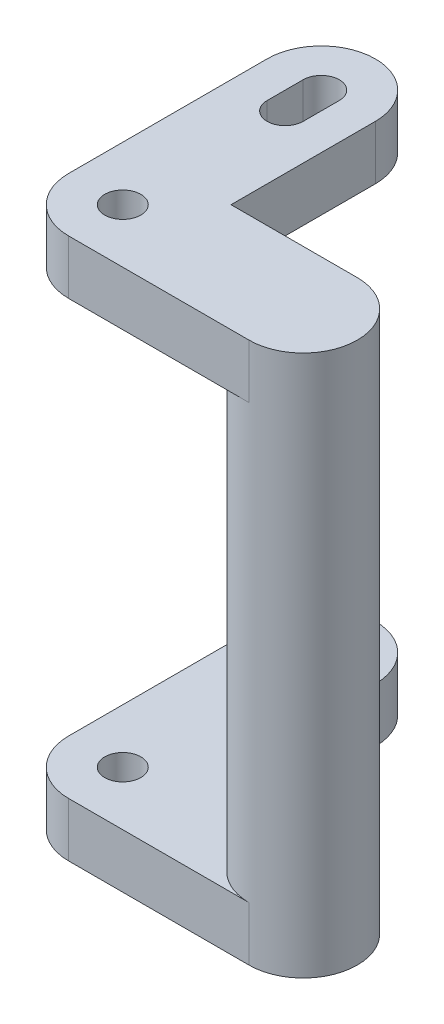
ISO-10303-21;
HEADER;
FILE_DESCRIPTION(('STEP AP214'),'2;1');
FILE_NAME('part.step','',(''),(''),'','','');
FILE_SCHEMA(('AUTOMOTIVE_DESIGN { 1 0 10303 214 1 1 1 1 }'));
ENDSEC;
DATA;
#1=APPLICATION_CONTEXT('core data for automotive mechanical design processes');
#2=APPLICATION_PROTOCOL_DEFINITION('international standard','automotive_design',2000,#1);
#3=PRODUCT_CONTEXT('',#1,'mechanical');
#4=PRODUCT('Part','Part','',(#3));
#5=PRODUCT_RELATED_PRODUCT_CATEGORY('part','',(#4));
#6=PRODUCT_DEFINITION_FORMATION('','',#4);
#7=PRODUCT_DEFINITION_CONTEXT('part definition',#1,'design');
#8=PRODUCT_DEFINITION('design','',#6,#7);
#9=PRODUCT_DEFINITION_SHAPE('','',#8);
#10=(LENGTH_UNIT() NAMED_UNIT(*) SI_UNIT(.MILLI.,.METRE.));
#11=(NAMED_UNIT(*) PLANE_ANGLE_UNIT() SI_UNIT($,.RADIAN.));
#12=(NAMED_UNIT(*) SI_UNIT($,.STERADIAN.) SOLID_ANGLE_UNIT());
#13=UNCERTAINTY_MEASURE_WITH_UNIT(LENGTH_MEASURE(1.E-05),#10,'distance_accuracy_value','');
#14=(GEOMETRIC_REPRESENTATION_CONTEXT(3) GLOBAL_UNCERTAINTY_ASSIGNED_CONTEXT((#13)) GLOBAL_UNIT_ASSIGNED_CONTEXT((#10,
#11,#12)) REPRESENTATION_CONTEXT('',''));
#15=CARTESIAN_POINT('',(0.,0.,0.));
#16=DIRECTION('',(0.,0.,1.));
#17=DIRECTION('',(1.,0.,0.));
#18=AXIS2_PLACEMENT_3D('',#15,#16,#17);
#19=CARTESIAN_POINT('',(0.,1.5,-3.));
#20=DIRECTION('',(0.,1.,0.));
#21=DIRECTION('',(0.,0.,1.));
#22=AXIS2_PLACEMENT_3D('',#19,#20,#21);
#23=PLANE('',#22);
#24=CARTESIAN_POINT('',(5.,1.5,2.50000000000002));
#25=DIRECTION('',(0.,1.,0.));
#26=DIRECTION('',(0.,0.,1.));
#27=AXIS2_PLACEMENT_3D('',#24,#25,#26);
#28=CIRCLE('',#27,1.5);
#29=CARTESIAN_POINT('',(5.00000000000001,1.5,1.00000000000002));
#30=VERTEX_POINT('',#29);
#31=CARTESIAN_POINT('',(5.,1.5,4.00000000000002));
#32=VERTEX_POINT('',#31);
#33=EDGE_CURVE('E11',#30,#32,#28,.T.);
#34=ORIENTED_EDGE('',*,*,#33,.F.);
#35=DIRECTION('',(-1.,0.,0.));
#36=VECTOR('',#35,1.);
#37=CARTESIAN_POINT('',(5.00000000000001,1.5,1.00000000000002));
#38=LINE('',#37,#36);
#39=CARTESIAN_POINT('',(1.5,1.5,1.00000000000001));
#40=VERTEX_POINT('',#39);
#41=EDGE_CURVE('E326',#30,#40,#38,.T.);
#42=ORIENTED_EDGE('',*,*,#41,.T.);
#43=DIRECTION('',(0.,0.,-1.));
#44=VECTOR('',#43,1.);
#45=CARTESIAN_POINT('',(1.5,1.5,-2.5));
#46=LINE('',#45,#44);
#47=CARTESIAN_POINT('',(1.5,1.5,-3.));
#48=VERTEX_POINT('',#47);
#49=EDGE_CURVE('E328',#40,#48,#46,.T.);
#50=ORIENTED_EDGE('',*,*,#49,.T.);
#51=CARTESIAN_POINT('',(0.,1.5,-3.));
#52=DIRECTION('',(0.,1.,0.));
#53=DIRECTION('',(0.,0.,1.));
#54=AXIS2_PLACEMENT_3D('',#51,#52,#53);
#55=CIRCLE('',#54,1.5);
#56=CARTESIAN_POINT('',(-1.5,1.5,-3.));
#57=VERTEX_POINT('',#56);
#58=EDGE_CURVE('E330',#48,#57,#55,.T.);
#59=ORIENTED_EDGE('',*,*,#58,.T.);
#60=DIRECTION('',(0.,0.,1.));
#61=VECTOR('',#60,1.);
#62=CARTESIAN_POINT('',(-1.5,1.5,-2.5));
#63=LINE('',#62,#61);
#64=CARTESIAN_POINT('',(-1.5,1.5,2.5));
#65=VERTEX_POINT('',#64);
#66=EDGE_CURVE('E318',#57,#65,#63,.T.);
#67=ORIENTED_EDGE('',*,*,#66,.T.);
#68=CARTESIAN_POINT('',(0.,1.5,2.5));
#69=DIRECTION('',(0.,1.,0.));
#70=DIRECTION('',(0.,0.,1.));
#71=AXIS2_PLACEMENT_3D('',#68,#69,#70);
#72=CIRCLE('',#71,1.5);
#73=CARTESIAN_POINT('',(0.,1.5,4.));
#74=VERTEX_POINT('',#73);
#75=EDGE_CURVE('E320',#65,#74,#72,.T.);
#76=ORIENTED_EDGE('',*,*,#75,.T.);
#77=DIRECTION('',(1.,0.,0.));
#78=VECTOR('',#77,1.);
#79=CARTESIAN_POINT('',(5.,1.5,4.00000000000002));
#80=LINE('',#79,#78);
#81=EDGE_CURVE('E323',#74,#32,#80,.T.);
#82=ORIENTED_EDGE('',*,*,#81,.T.);
#83=EDGE_LOOP('',(#34,#42,#50,#59,#67,#76,#82));
#84=FACE_BOUND('',#83,.T.);
#85=CARTESIAN_POINT('',(0.,1.5,2.5));
#86=DIRECTION('',(0.,1.,0.));
#87=DIRECTION('',(0.,0.,1.));
#88=AXIS2_PLACEMENT_3D('',#85,#86,#87);
#89=CIRCLE('',#88,0.5);
#90=CARTESIAN_POINT('',(0.,1.5,3.));
#91=VERTEX_POINT('',#90);
#92=EDGE_CURVE('E312',#91,#91,#89,.T.);
#93=ORIENTED_EDGE('',*,*,#92,.F.);
#94=EDGE_LOOP('',(#93));
#95=FACE_BOUND('',#94,.T.);
#96=DIRECTION('',(0.,0.,1.));
#97=VECTOR('',#96,1.);
#98=CARTESIAN_POINT('',(-0.5,1.5,-3.));
#99=LINE('',#98,#97);
#100=CARTESIAN_POINT('',(-0.5,1.5,-3.));
#101=VERTEX_POINT('',#100);
#102=CARTESIAN_POINT('',(-0.5,1.5,-2.));
#103=VERTEX_POINT('',#102);
#104=EDGE_CURVE('E285',#101,#103,#99,.T.);
#105=ORIENTED_EDGE('',*,*,#104,.F.);
#106=CARTESIAN_POINT('',(0.,1.5,-3.));
#107=DIRECTION('',(0.,1.,0.));
#108=DIRECTION('',(0.,0.,1.));
#109=AXIS2_PLACEMENT_3D('',#106,#107,#108);
#110=CIRCLE('',#109,0.5);
#111=CARTESIAN_POINT('',(0.5,1.5,-3.));
#112=VERTEX_POINT('',#111);
#113=EDGE_CURVE('E283',#112,#101,#110,.T.);
#114=ORIENTED_EDGE('',*,*,#113,.F.);
#115=DIRECTION('',(0.,0.,-1.));
#116=VECTOR('',#115,1.);
#117=CARTESIAN_POINT('',(0.5,1.5,-3.));
#118=LINE('',#117,#116);
#119=CARTESIAN_POINT('',(0.5,1.5,-2.));
#120=VERTEX_POINT('',#119);
#121=EDGE_CURVE('E290',#120,#112,#118,.T.);
#122=ORIENTED_EDGE('',*,*,#121,.F.);
#123=CARTESIAN_POINT('',(0.,1.5,-2.));
#124=DIRECTION('',(0.,1.,0.));
#125=DIRECTION('',(0.,0.,1.));
#126=AXIS2_PLACEMENT_3D('',#123,#124,#125);
#127=CIRCLE('',#126,0.5);
#128=EDGE_CURVE('E288',#103,#120,#127,.T.);
#129=ORIENTED_EDGE('',*,*,#128,.F.);
#130=EDGE_LOOP('',(#105,#114,#122,#129));
#131=FACE_BOUND('',#130,.T.);
#132=ADVANCED_FACE('F34',(#84,#95,#131),#23,.T.);
#133=CARTESIAN_POINT('',(0.,0.,-3.));
#134=DIRECTION('',(0.,1.,0.));
#135=DIRECTION('',(0.,0.,1.));
#136=AXIS2_PLACEMENT_3D('',#133,#134,#135);
#137=PLANE('',#136);
#138=CARTESIAN_POINT('',(0.,0.,2.5));
#139=DIRECTION('',(0.,1.,0.));
#140=DIRECTION('',(0.,0.,1.));
#141=AXIS2_PLACEMENT_3D('',#138,#139,#140);
#142=CIRCLE('',#141,0.5);
#143=CARTESIAN_POINT('',(0.,0.,3.));
#144=VERTEX_POINT('',#143);
#145=EDGE_CURVE('E311',#144,#144,#142,.T.);
#146=ORIENTED_EDGE('',*,*,#145,.T.);
#147=EDGE_LOOP('',(#146));
#148=FACE_BOUND('',#147,.T.);
#149=DIRECTION('',(0.,0.,1.));
#150=VECTOR('',#149,1.);
#151=CARTESIAN_POINT('',(-1.5,0.,-2.5));
#152=LINE('',#151,#150);
#153=CARTESIAN_POINT('',(-1.5,0.,-3.));
#154=VERTEX_POINT('',#153);
#155=CARTESIAN_POINT('',(-1.5,0.,2.5));
#156=VERTEX_POINT('',#155);
#157=EDGE_CURVE('E315',#154,#156,#152,.T.);
#158=ORIENTED_EDGE('',*,*,#157,.F.);
#159=CARTESIAN_POINT('',(0.,0.,-3.));
#160=DIRECTION('',(0.,1.,0.));
#161=DIRECTION('',(0.,0.,1.));
#162=AXIS2_PLACEMENT_3D('',#159,#160,#161);
#163=CIRCLE('',#162,1.5);
#164=CARTESIAN_POINT('',(1.5,0.,-3.));
#165=VERTEX_POINT('',#164);
#166=EDGE_CURVE('E321',#165,#154,#163,.T.);
#167=ORIENTED_EDGE('',*,*,#166,.F.);
#168=DIRECTION('',(0.,0.,-1.));
#169=VECTOR('',#168,1.);
#170=CARTESIAN_POINT('',(1.5,0.,-3.));
#171=LINE('',#170,#169);
#172=CARTESIAN_POINT('',(1.5,0.,1.00000000000001));
#173=VERTEX_POINT('',#172);
#174=EDGE_CURVE('E343',#173,#165,#171,.T.);
#175=ORIENTED_EDGE('',*,*,#174,.F.);
#176=DIRECTION('',(-1.,0.,0.));
#177=VECTOR('',#176,1.);
#178=CARTESIAN_POINT('',(5.00000000000001,0.,1.00000000000002));
#179=LINE('',#178,#177);
#180=CARTESIAN_POINT('',(5.00000000000001,0.,1.00000000000002));
#181=VERTEX_POINT('',#180);
#182=EDGE_CURVE('E340',#181,#173,#179,.T.);
#183=ORIENTED_EDGE('',*,*,#182,.F.);
#184=CARTESIAN_POINT('',(5.,0.,2.50000000000002));
#185=DIRECTION('',(0.,1.,0.));
#186=DIRECTION('',(0.,0.,1.));
#187=AXIS2_PLACEMENT_3D('',#184,#185,#186);
#188=CIRCLE('',#187,1.5);
#189=CARTESIAN_POINT('',(5.,0.,4.00000000000002));
#190=VERTEX_POINT('',#189);
#191=EDGE_CURVE('E338',#190,#181,#188,.T.);
#192=ORIENTED_EDGE('',*,*,#191,.F.);
#193=DIRECTION('',(1.,0.,0.));
#194=VECTOR('',#193,1.);
#195=CARTESIAN_POINT('',(5.,0.,4.00000000000002));
#196=LINE('',#195,#194);
#197=CARTESIAN_POINT('',(0.,0.,4.));
#198=VERTEX_POINT('',#197);
#199=EDGE_CURVE('E336',#198,#190,#196,.T.);
#200=ORIENTED_EDGE('',*,*,#199,.F.);
#201=CARTESIAN_POINT('',(0.,0.,2.5));
#202=DIRECTION('',(0.,1.,0.));
#203=DIRECTION('',(0.,0.,1.));
#204=AXIS2_PLACEMENT_3D('',#201,#202,#203);
#205=CIRCLE('',#204,1.5);
#206=EDGE_CURVE('E334',#156,#198,#205,.T.);
#207=ORIENTED_EDGE('',*,*,#206,.F.);
#208=EDGE_LOOP('',(#158,#167,#175,#183,#192,#200,#207));
#209=FACE_BOUND('',#208,.T.);
#210=CARTESIAN_POINT('',(0.,0.,-3.));
#211=DIRECTION('',(0.,1.,0.));
#212=DIRECTION('',(0.,0.,1.));
#213=AXIS2_PLACEMENT_3D('',#210,#211,#212);
#214=CIRCLE('',#213,0.5);
#215=CARTESIAN_POINT('',(0.5,0.,-3.));
#216=VERTEX_POINT('',#215);
#217=CARTESIAN_POINT('',(-0.5,0.,-3.));
#218=VERTEX_POINT('',#217);
#219=EDGE_CURVE('E281',#216,#218,#214,.T.);
#220=ORIENTED_EDGE('',*,*,#219,.T.);
#221=DIRECTION('',(0.,0.,1.));
#222=VECTOR('',#221,1.);
#223=CARTESIAN_POINT('',(-0.5,0.,-3.));
#224=LINE('',#223,#222);
#225=CARTESIAN_POINT('',(-0.5,0.,-2.));
#226=VERTEX_POINT('',#225);
#227=EDGE_CURVE('E295',#218,#226,#224,.T.);
#228=ORIENTED_EDGE('',*,*,#227,.T.);
#229=CARTESIAN_POINT('',(0.,0.,-2.));
#230=DIRECTION('',(0.,1.,0.));
#231=DIRECTION('',(0.,0.,1.));
#232=AXIS2_PLACEMENT_3D('',#229,#230,#231);
#233=CIRCLE('',#232,0.5);
#234=CARTESIAN_POINT('',(0.5,0.,-2.));
#235=VERTEX_POINT('',#234);
#236=EDGE_CURVE('E298',#226,#235,#233,.T.);
#237=ORIENTED_EDGE('',*,*,#236,.T.);
#238=DIRECTION('',(0.,0.,-1.));
#239=VECTOR('',#238,1.);
#240=CARTESIAN_POINT('',(0.5,0.,-3.));
#241=LINE('',#240,#239);
#242=EDGE_CURVE('E286',#235,#216,#241,.T.);
#243=ORIENTED_EDGE('',*,*,#242,.T.);
#244=EDGE_LOOP('',(#220,#228,#237,#243));
#245=FACE_BOUND('',#244,.T.);
#246=ADVANCED_FACE('F375',(#148,#209,#245),#137,.F.);
#247=CARTESIAN_POINT('',(-1.5,1.5,-2.5));
#248=DIRECTION('',(1.,0.,0.));
#249=DIRECTION('',(0.,0.,-1.));
#250=AXIS2_PLACEMENT_3D('',#247,#248,#249);
#251=PLANE('',#250);
#252=ORIENTED_EDGE('',*,*,#157,.T.);
#253=DIRECTION('',(0.,-1.,0.));
#254=VECTOR('',#253,1.);
#255=CARTESIAN_POINT('',(-1.5,1.5,2.5));
#256=LINE('',#255,#254);
#257=EDGE_CURVE('E38',#65,#156,#256,.T.);
#258=ORIENTED_EDGE('',*,*,#257,.F.);
#259=ORIENTED_EDGE('',*,*,#66,.F.);
#260=DIRECTION('',(0.,-1.,0.));
#261=VECTOR('',#260,1.);
#262=CARTESIAN_POINT('',(-1.5,1.5,-3.));
#263=LINE('',#262,#261);
#264=EDGE_CURVE('E332',#57,#154,#263,.T.);
#265=ORIENTED_EDGE('',*,*,#264,.T.);
#266=EDGE_LOOP('',(#252,#258,#259,#265));
#267=FACE_BOUND('',#266,.T.);
#268=ADVANCED_FACE('F36',(#267),#251,.F.);
#269=CARTESIAN_POINT('',(0.,1.5,2.5));
#270=DIRECTION('',(0.,-1.,0.));
#271=DIRECTION('',(0.,0.,-1.));
#272=AXIS2_PLACEMENT_3D('',#269,#270,#271);
#273=CYLINDRICAL_SURFACE('',#272,1.5);
#274=ORIENTED_EDGE('',*,*,#206,.T.);
#275=DIRECTION('',(0.,-1.,0.));
#276=VECTOR('',#275,1.);
#277=CARTESIAN_POINT('',(0.,1.5,4.));
#278=LINE('',#277,#276);
#279=EDGE_CURVE('E360',#74,#198,#278,.T.);
#280=ORIENTED_EDGE('',*,*,#279,.F.);
#281=ORIENTED_EDGE('',*,*,#75,.F.);
#282=ORIENTED_EDGE('',*,*,#257,.T.);
#283=EDGE_LOOP('',(#274,#280,#281,#282));
#284=FACE_BOUND('',#283,.T.);
#285=ADVANCED_FACE('F371',(#284),#273,.T.);
#286=CARTESIAN_POINT('',(5.,1.5,4.00000000000002));
#287=DIRECTION('',(0.,0.,-1.));
#288=DIRECTION('',(-1.,0.,0.));
#289=AXIS2_PLACEMENT_3D('',#286,#287,#288);
#290=PLANE('',#289);
#291=ORIENTED_EDGE('',*,*,#199,.T.);
#292=DIRECTION('',(0.,-1.,0.));
#293=VECTOR('',#292,1.);
#294=CARTESIAN_POINT('',(5.,1.5,4.00000000000002));
#295=LINE('',#294,#293);
#296=EDGE_CURVE('E358',#32,#190,#295,.T.);
#297=ORIENTED_EDGE('',*,*,#296,.F.);
#298=ORIENTED_EDGE('',*,*,#81,.F.);
#299=ORIENTED_EDGE('',*,*,#279,.T.);
#300=EDGE_LOOP('',(#291,#297,#298,#299));
#301=FACE_BOUND('',#300,.T.);
#302=ADVANCED_FACE('F380',(#301),#290,.F.);
#303=CARTESIAN_POINT('',(5.,1.5,2.50000000000002));
#304=DIRECTION('',(0.,-1.,0.));
#305=DIRECTION('',(0.,0.,-1.));
#306=AXIS2_PLACEMENT_3D('',#303,#304,#305);
#307=CYLINDRICAL_SURFACE('',#306,1.5);
#308=ORIENTED_EDGE('',*,*,#191,.T.);
#309=DIRECTION('',(0.,-1.,0.));
#310=VECTOR('',#309,1.);
#311=CARTESIAN_POINT('',(5.00000000000001,1.5,1.00000000000002));
#312=LINE('',#311,#310);
#313=EDGE_CURVE('E355',#30,#181,#312,.T.);
#314=ORIENTED_EDGE('',*,*,#313,.F.);
#315=ORIENTED_EDGE('',*,*,#33,.T.);
#316=ORIENTED_EDGE('',*,*,#296,.T.);
#317=EDGE_LOOP('',(#308,#314,#315,#316));
#318=FACE_BOUND('',#317,.T.);
#319=CARTESIAN_POINT('',(5.,13.5,2.50000000000002));
#320=DIRECTION('',(0.,1.,0.));
#321=DIRECTION('',(0.,0.,1.));
#322=AXIS2_PLACEMENT_3D('',#319,#320,#321);
#323=CIRCLE('',#322,1.5);
#324=CARTESIAN_POINT('',(5.00000000000001,13.5,1.00000000000002));
#325=VERTEX_POINT('',#324);
#326=CARTESIAN_POINT('',(5.,13.5,4.00000000000002));
#327=VERTEX_POINT('',#326);
#328=EDGE_CURVE('E50',#325,#327,#323,.T.);
#329=ORIENTED_EDGE('',*,*,#328,.F.);
#330=DIRECTION('',(0.,-1.,0.));
#331=VECTOR('',#330,1.);
#332=CARTESIAN_POINT('',(5.00000000000001,15.,1.00000000000002));
#333=LINE('',#332,#331);
#334=CARTESIAN_POINT('',(5.00000000000001,15.,1.00000000000002));
#335=VERTEX_POINT('',#334);
#336=EDGE_CURVE('E265',#335,#325,#333,.T.);
#337=ORIENTED_EDGE('',*,*,#336,.F.);
#338=CARTESIAN_POINT('',(5.,15.,2.50000000000002));
#339=DIRECTION('',(0.,1.,0.));
#340=DIRECTION('',(0.,0.,-1.));
#341=AXIS2_PLACEMENT_3D('',#338,#339,#340);
#342=CIRCLE('',#341,1.5);
#343=CARTESIAN_POINT('',(5.,15.,4.00000000000002));
#344=VERTEX_POINT('',#343);
#345=EDGE_CURVE('E245',#344,#335,#342,.T.);
#346=ORIENTED_EDGE('',*,*,#345,.F.);
#347=DIRECTION('',(0.,-1.,0.));
#348=VECTOR('',#347,1.);
#349=CARTESIAN_POINT('',(5.,15.,4.00000000000002));
#350=LINE('',#349,#348);
#351=EDGE_CURVE('E267',#344,#327,#350,.T.);
#352=ORIENTED_EDGE('',*,*,#351,.T.);
#353=EDGE_LOOP('',(#329,#337,#346,#352));
#354=FACE_BOUND('',#353,.T.);
#355=ADVANCED_FACE('F382',(#318,#354),#307,.T.);
#356=CARTESIAN_POINT('',(5.00000000000001,1.5,1.00000000000002));
#357=DIRECTION('',(0.,0.,1.));
#358=DIRECTION('',(1.,0.,0.));
#359=AXIS2_PLACEMENT_3D('',#356,#357,#358);
#360=PLANE('',#359);
#361=ORIENTED_EDGE('',*,*,#182,.T.);
#362=DIRECTION('',(0.,-1.,0.));
#363=VECTOR('',#362,1.);
#364=CARTESIAN_POINT('',(1.5,1.5,1.00000000000001));
#365=LINE('',#364,#363);
#366=EDGE_CURVE('E352',#40,#173,#365,.T.);
#367=ORIENTED_EDGE('',*,*,#366,.F.);
#368=ORIENTED_EDGE('',*,*,#41,.F.);
#369=ORIENTED_EDGE('',*,*,#313,.T.);
#370=EDGE_LOOP('',(#361,#367,#368,#369));
#371=FACE_BOUND('',#370,.T.);
#372=ADVANCED_FACE('F395',(#371),#360,.F.);
#373=CARTESIAN_POINT('',(1.5,1.5,-3.));
#374=DIRECTION('',(-1.,0.,0.));
#375=DIRECTION('',(0.,0.,1.));
#376=AXIS2_PLACEMENT_3D('',#373,#374,#375);
#377=PLANE('',#376);
#378=ORIENTED_EDGE('',*,*,#174,.T.);
#379=DIRECTION('',(0.,-1.,0.));
#380=VECTOR('',#379,1.);
#381=CARTESIAN_POINT('',(1.5,1.5,-3.));
#382=LINE('',#381,#380);
#383=EDGE_CURVE('E349',#48,#165,#382,.T.);
#384=ORIENTED_EDGE('',*,*,#383,.F.);
#385=ORIENTED_EDGE('',*,*,#49,.F.);
#386=ORIENTED_EDGE('',*,*,#366,.T.);
#387=EDGE_LOOP('',(#378,#384,#385,#386));
#388=FACE_BOUND('',#387,.T.);
#389=ADVANCED_FACE('F397',(#388),#377,.F.);
#390=CARTESIAN_POINT('',(0.,1.5,-3.));
#391=DIRECTION('',(0.,-1.,0.));
#392=DIRECTION('',(0.,0.,-1.));
#393=AXIS2_PLACEMENT_3D('',#390,#391,#392);
#394=CYLINDRICAL_SURFACE('',#393,1.5);
#395=ORIENTED_EDGE('',*,*,#166,.T.);
#396=ORIENTED_EDGE('',*,*,#264,.F.);
#397=ORIENTED_EDGE('',*,*,#58,.F.);
#398=ORIENTED_EDGE('',*,*,#383,.T.);
#399=EDGE_LOOP('',(#395,#396,#397,#398));
#400=FACE_BOUND('',#399,.T.);
#401=ADVANCED_FACE('F391',(#400),#394,.T.);
#402=CARTESIAN_POINT('',(0.,1.5,2.5));
#403=DIRECTION('',(0.,-1.,0.));
#404=DIRECTION('',(0.,0.,-1.));
#405=AXIS2_PLACEMENT_3D('',#402,#403,#404);
#406=CYLINDRICAL_SURFACE('',#405,0.5);
#407=ORIENTED_EDGE('',*,*,#92,.T.);
#408=EDGE_LOOP('',(#407));
#409=FACE_BOUND('',#408,.T.);
#410=ORIENTED_EDGE('',*,*,#145,.F.);
#411=EDGE_LOOP('',(#410));
#412=FACE_BOUND('',#411,.T.);
#413=ADVANCED_FACE('F404',(#409,#412),#406,.F.);
#414=CARTESIAN_POINT('',(0.,1.5,-3.));
#415=DIRECTION('',(0.,-1.,0.));
#416=DIRECTION('',(0.,0.,-1.));
#417=AXIS2_PLACEMENT_3D('',#414,#415,#416);
#418=CYLINDRICAL_SURFACE('',#417,0.5);
#419=ORIENTED_EDGE('',*,*,#219,.F.);
#420=DIRECTION('',(0.,-1.,0.));
#421=VECTOR('',#420,1.);
#422=CARTESIAN_POINT('',(0.5,1.5,-3.));
#423=LINE('',#422,#421);
#424=EDGE_CURVE('E292',#112,#216,#423,.T.);
#425=ORIENTED_EDGE('',*,*,#424,.F.);
#426=ORIENTED_EDGE('',*,*,#113,.T.);
#427=DIRECTION('',(0.,-1.,0.));
#428=VECTOR('',#427,1.);
#429=CARTESIAN_POINT('',(-0.5,1.5,-3.));
#430=LINE('',#429,#428);
#431=EDGE_CURVE('E308',#101,#218,#430,.T.);
#432=ORIENTED_EDGE('',*,*,#431,.T.);
#433=EDGE_LOOP('',(#419,#425,#426,#432));
#434=FACE_BOUND('',#433,.T.);
#435=ADVANCED_FACE('F417',(#434),#418,.F.);
#436=CARTESIAN_POINT('',(-0.5,1.5,-3.));
#437=DIRECTION('',(1.,0.,0.));
#438=DIRECTION('',(0.,0.,-1.));
#439=AXIS2_PLACEMENT_3D('',#436,#437,#438);
#440=PLANE('',#439);
#441=ORIENTED_EDGE('',*,*,#227,.F.);
#442=ORIENTED_EDGE('',*,*,#431,.F.);
#443=ORIENTED_EDGE('',*,*,#104,.T.);
#444=DIRECTION('',(0.,-1.,0.));
#445=VECTOR('',#444,1.);
#446=CARTESIAN_POINT('',(-0.5,1.5,-2.));
#447=LINE('',#446,#445);
#448=EDGE_CURVE('E306',#103,#226,#447,.T.);
#449=ORIENTED_EDGE('',*,*,#448,.T.);
#450=EDGE_LOOP('',(#441,#442,#443,#449));
#451=FACE_BOUND('',#450,.T.);
#452=ADVANCED_FACE('F421',(#451),#440,.T.);
#453=CARTESIAN_POINT('',(0.,1.5,-2.));
#454=DIRECTION('',(0.,-1.,0.));
#455=DIRECTION('',(0.,0.,-1.));
#456=AXIS2_PLACEMENT_3D('',#453,#454,#455);
#457=CYLINDRICAL_SURFACE('',#456,0.5);
#458=ORIENTED_EDGE('',*,*,#236,.F.);
#459=ORIENTED_EDGE('',*,*,#448,.F.);
#460=ORIENTED_EDGE('',*,*,#128,.T.);
#461=DIRECTION('',(0.,-1.,0.));
#462=VECTOR('',#461,1.);
#463=CARTESIAN_POINT('',(0.5,1.5,-2.));
#464=LINE('',#463,#462);
#465=EDGE_CURVE('E58',#120,#235,#464,.T.);
#466=ORIENTED_EDGE('',*,*,#465,.T.);
#467=EDGE_LOOP('',(#458,#459,#460,#466));
#468=FACE_BOUND('',#467,.T.);
#469=ADVANCED_FACE('F425',(#468),#457,.F.);
#470=CARTESIAN_POINT('',(0.5,1.5,-3.));
#471=DIRECTION('',(-1.,0.,0.));
#472=DIRECTION('',(0.,0.,1.));
#473=AXIS2_PLACEMENT_3D('',#470,#471,#472);
#474=PLANE('',#473);
#475=ORIENTED_EDGE('',*,*,#242,.F.);
#476=ORIENTED_EDGE('',*,*,#465,.F.);
#477=ORIENTED_EDGE('',*,*,#121,.T.);
#478=ORIENTED_EDGE('',*,*,#424,.T.);
#479=EDGE_LOOP('',(#475,#476,#477,#478));
#480=FACE_BOUND('',#479,.T.);
#481=ADVANCED_FACE('F429',(#480),#474,.T.);
#482=CARTESIAN_POINT('',(5.,15.,2.50000000000002));
#483=DIRECTION('',(0.,-1.,0.));
#484=DIRECTION('',(0.,0.,-1.));
#485=AXIS2_PLACEMENT_3D('',#482,#483,#484);
#486=PLANE('',#485);
#487=CARTESIAN_POINT('',(0.,15.,2.49999999999999));
#488=DIRECTION('',(0.,1.,0.));
#489=DIRECTION('',(0.,0.,1.));
#490=AXIS2_PLACEMENT_3D('',#487,#488,#489);
#491=CIRCLE('',#490,0.5);
#492=CARTESIAN_POINT('',(0.,15.,2.99999999999999));
#493=VERTEX_POINT('',#492);
#494=EDGE_CURVE('E228',#493,#493,#491,.T.);
#495=ORIENTED_EDGE('',*,*,#494,.F.);
#496=EDGE_LOOP('',(#495));
#497=FACE_BOUND('',#496,.T.);
#498=DIRECTION('',(0.,0.,-1.));
#499=VECTOR('',#498,1.);
#500=CARTESIAN_POINT('',(1.5,15.,-2.5));
#501=LINE('',#500,#499);
#502=CARTESIAN_POINT('',(1.5,15.,1.00000000000001));
#503=VERTEX_POINT('',#502);
#504=CARTESIAN_POINT('',(1.5,15.,-3.));
#505=VERTEX_POINT('',#504);
#506=EDGE_CURVE('E234',#503,#505,#501,.T.);
#507=ORIENTED_EDGE('',*,*,#506,.T.);
#508=CARTESIAN_POINT('',(0.,15.,-3.));
#509=DIRECTION('',(0.,1.,0.));
#510=DIRECTION('',(0.,0.,1.));
#511=AXIS2_PLACEMENT_3D('',#508,#509,#510);
#512=CIRCLE('',#511,1.5);
#513=CARTESIAN_POINT('',(-1.5,15.,-3.));
#514=VERTEX_POINT('',#513);
#515=EDGE_CURVE('E236',#505,#514,#512,.T.);
#516=ORIENTED_EDGE('',*,*,#515,.T.);
#517=DIRECTION('',(0.,0.,1.));
#518=VECTOR('',#517,1.);
#519=CARTESIAN_POINT('',(-1.5,15.,-3.));
#520=LINE('',#519,#518);
#521=CARTESIAN_POINT('',(-1.5,15.,2.5));
#522=VERTEX_POINT('',#521);
#523=EDGE_CURVE('E239',#514,#522,#520,.T.);
#524=ORIENTED_EDGE('',*,*,#523,.T.);
#525=CARTESIAN_POINT('',(0.,15.,2.49999999999999));
#526=DIRECTION('',(0.,1.,0.));
#527=DIRECTION('',(0.,0.,-1.));
#528=AXIS2_PLACEMENT_3D('',#525,#526,#527);
#529=CIRCLE('',#528,1.50000000000001);
#530=CARTESIAN_POINT('',(0.,15.,4.));
#531=VERTEX_POINT('',#530);
#532=EDGE_CURVE('E241',#522,#531,#529,.T.);
#533=ORIENTED_EDGE('',*,*,#532,.T.);
#534=DIRECTION('',(1.,0.,0.));
#535=VECTOR('',#534,1.);
#536=CARTESIAN_POINT('',(5.,15.,4.00000000000002));
#537=LINE('',#536,#535);
#538=EDGE_CURVE('E243',#531,#344,#537,.T.);
#539=ORIENTED_EDGE('',*,*,#538,.T.);
#540=ORIENTED_EDGE('',*,*,#345,.T.);
#541=DIRECTION('',(-1.,0.,0.));
#542=VECTOR('',#541,1.);
#543=CARTESIAN_POINT('',(1.5,15.,1.00000000000001));
#544=LINE('',#543,#542);
#545=EDGE_CURVE('E247',#335,#503,#544,.T.);
#546=ORIENTED_EDGE('',*,*,#545,.T.);
#547=EDGE_LOOP('',(#507,#516,#524,#533,#539,#540,#546));
#548=FACE_BOUND('',#547,.T.);
#549=CARTESIAN_POINT('',(0.,15.,-3.));
#550=DIRECTION('',(0.,1.,0.));
#551=DIRECTION('',(0.,0.,1.));
#552=AXIS2_PLACEMENT_3D('',#549,#550,#551);
#553=CIRCLE('',#552,0.5);
#554=CARTESIAN_POINT('',(0.5,15.,-3.));
#555=VERTEX_POINT('',#554);
#556=CARTESIAN_POINT('',(-0.5,15.,-3.));
#557=VERTEX_POINT('',#556);
#558=EDGE_CURVE('E186',#555,#557,#553,.T.);
#559=ORIENTED_EDGE('',*,*,#558,.F.);
#560=DIRECTION('',(0.,0.,-1.));
#561=VECTOR('',#560,1.);
#562=CARTESIAN_POINT('',(0.5,15.,-3.));
#563=LINE('',#562,#561);
#564=CARTESIAN_POINT('',(0.5,15.,-2.));
#565=VERTEX_POINT('',#564);
#566=EDGE_CURVE('E212',#565,#555,#563,.T.);
#567=ORIENTED_EDGE('',*,*,#566,.F.);
#568=CARTESIAN_POINT('',(0.,15.,-2.));
#569=DIRECTION('',(0.,1.,0.));
#570=DIRECTION('',(0.,0.,1.));
#571=AXIS2_PLACEMENT_3D('',#568,#569,#570);
#572=CIRCLE('',#571,0.5);
#573=CARTESIAN_POINT('',(-0.5,15.,-2.));
#574=VERTEX_POINT('',#573);
#575=EDGE_CURVE('E210',#574,#565,#572,.T.);
#576=ORIENTED_EDGE('',*,*,#575,.F.);
#577=DIRECTION('',(0.,0.,1.));
#578=VECTOR('',#577,1.);
#579=CARTESIAN_POINT('',(-0.5,15.,-3.));
#580=LINE('',#579,#578);
#581=EDGE_CURVE('E196',#557,#574,#580,.T.);
#582=ORIENTED_EDGE('',*,*,#581,.F.);
#583=EDGE_LOOP('',(#559,#567,#576,#582));
#584=FACE_BOUND('',#583,.T.);
#585=ADVANCED_FACE('F208',(#497,#548,#584),#486,.F.);
#586=CARTESIAN_POINT('',(5.,13.5,2.50000000000002));
#587=DIRECTION('',(0.,-1.,0.));
#588=DIRECTION('',(0.,0.,-1.));
#589=AXIS2_PLACEMENT_3D('',#586,#587,#588);
#590=PLANE('',#589);
#591=DIRECTION('',(-1.,0.,0.));
#592=VECTOR('',#591,1.);
#593=CARTESIAN_POINT('',(1.5,13.5,1.00000000000001));
#594=LINE('',#593,#592);
#595=CARTESIAN_POINT('',(1.5,13.5,1.00000000000001));
#596=VERTEX_POINT('',#595);
#597=EDGE_CURVE('E237',#325,#596,#594,.T.);
#598=ORIENTED_EDGE('',*,*,#597,.F.);
#599=ORIENTED_EDGE('',*,*,#328,.T.);
#600=DIRECTION('',(1.,0.,0.));
#601=VECTOR('',#600,1.);
#602=CARTESIAN_POINT('',(5.,13.5,4.00000000000002));
#603=LINE('',#602,#601);
#604=CARTESIAN_POINT('',(0.,13.5,4.));
#605=VERTEX_POINT('',#604);
#606=EDGE_CURVE('E258',#605,#327,#603,.T.);
#607=ORIENTED_EDGE('',*,*,#606,.F.);
#608=CARTESIAN_POINT('',(0.,13.5,2.49999999999999));
#609=DIRECTION('',(0.,1.,0.));
#610=DIRECTION('',(0.,0.,-1.));
#611=AXIS2_PLACEMENT_3D('',#608,#609,#610);
#612=CIRCLE('',#611,1.50000000000001);
#613=CARTESIAN_POINT('',(-1.5,13.5,2.5));
#614=VERTEX_POINT('',#613);
#615=EDGE_CURVE('E256',#614,#605,#612,.T.);
#616=ORIENTED_EDGE('',*,*,#615,.F.);
#617=DIRECTION('',(0.,0.,1.));
#618=VECTOR('',#617,1.);
#619=CARTESIAN_POINT('',(-1.5,13.5,2.5));
#620=LINE('',#619,#618);
#621=CARTESIAN_POINT('',(-1.5,13.5,-3.));
#622=VERTEX_POINT('',#621);
#623=EDGE_CURVE('E254',#622,#614,#620,.T.);
#624=ORIENTED_EDGE('',*,*,#623,.F.);
#625=CARTESIAN_POINT('',(0.,13.5,-3.));
#626=DIRECTION('',(0.,1.,0.));
#627=DIRECTION('',(0.,0.,1.));
#628=AXIS2_PLACEMENT_3D('',#625,#626,#627);
#629=CIRCLE('',#628,1.5);
#630=CARTESIAN_POINT('',(1.5,13.5,-3.));
#631=VERTEX_POINT('',#630);
#632=EDGE_CURVE('E251',#631,#622,#629,.T.);
#633=ORIENTED_EDGE('',*,*,#632,.F.);
#634=DIRECTION('',(0.,0.,-1.));
#635=VECTOR('',#634,1.);
#636=CARTESIAN_POINT('',(1.5,13.5,-3.));
#637=LINE('',#636,#635);
#638=EDGE_CURVE('E231',#596,#631,#637,.T.);
#639=ORIENTED_EDGE('',*,*,#638,.F.);
#640=EDGE_LOOP('',(#598,#599,#607,#616,#624,#633,#639));
#641=FACE_BOUND('',#640,.T.);
#642=CARTESIAN_POINT('',(0.,13.5,2.49999999999999));
#643=DIRECTION('',(0.,1.,0.));
#644=DIRECTION('',(0.,0.,1.));
#645=AXIS2_PLACEMENT_3D('',#642,#643,#644);
#646=CIRCLE('',#645,0.5);
#647=CARTESIAN_POINT('',(0.,13.5,2.99999999999999));
#648=VERTEX_POINT('',#647);
#649=EDGE_CURVE('E204',#648,#648,#646,.T.);
#650=ORIENTED_EDGE('',*,*,#649,.T.);
#651=EDGE_LOOP('',(#650));
#652=FACE_BOUND('',#651,.T.);
#653=DIRECTION('',(0.,0.,-1.));
#654=VECTOR('',#653,1.);
#655=CARTESIAN_POINT('',(0.5,13.5,-3.));
#656=LINE('',#655,#654);
#657=CARTESIAN_POINT('',(0.5,13.5,-2.));
#658=VERTEX_POINT('',#657);
#659=CARTESIAN_POINT('',(0.5,13.5,-3.));
#660=VERTEX_POINT('',#659);
#661=EDGE_CURVE('E197',#658,#660,#656,.T.);
#662=ORIENTED_EDGE('',*,*,#661,.T.);
#663=CARTESIAN_POINT('',(0.,13.5,-3.));
#664=DIRECTION('',(0.,1.,0.));
#665=DIRECTION('',(0.,0.,1.));
#666=AXIS2_PLACEMENT_3D('',#663,#664,#665);
#667=CIRCLE('',#666,0.5);
#668=CARTESIAN_POINT('',(-0.5,13.5,-3.));
#669=VERTEX_POINT('',#668);
#670=EDGE_CURVE('E216',#660,#669,#667,.T.);
#671=ORIENTED_EDGE('',*,*,#670,.T.);
#672=DIRECTION('',(0.,0.,1.));
#673=VECTOR('',#672,1.);
#674=CARTESIAN_POINT('',(-0.5,13.5,-3.));
#675=LINE('',#674,#673);
#676=CARTESIAN_POINT('',(-0.5,13.5,-2.));
#677=VERTEX_POINT('',#676);
#678=EDGE_CURVE('E203',#669,#677,#675,.T.);
#679=ORIENTED_EDGE('',*,*,#678,.T.);
#680=CARTESIAN_POINT('',(0.,13.5,-2.));
#681=DIRECTION('',(0.,1.,0.));
#682=DIRECTION('',(0.,0.,1.));
#683=AXIS2_PLACEMENT_3D('',#680,#681,#682);
#684=CIRCLE('',#683,0.5);
#685=EDGE_CURVE('E219',#677,#658,#684,.T.);
#686=ORIENTED_EDGE('',*,*,#685,.T.);
#687=EDGE_LOOP('',(#662,#671,#679,#686));
#688=FACE_BOUND('',#687,.T.);
#689=ADVANCED_FACE('F437',(#641,#652,#688),#590,.T.);
#690=CARTESIAN_POINT('',(1.5,15.,-3.));
#691=DIRECTION('',(-1.,0.,0.));
#692=DIRECTION('',(0.,0.,1.));
#693=AXIS2_PLACEMENT_3D('',#690,#691,#692);
#694=PLANE('',#693);
#695=ORIENTED_EDGE('',*,*,#638,.T.);
#696=DIRECTION('',(0.,-1.,0.));
#697=VECTOR('',#696,1.);
#698=CARTESIAN_POINT('',(1.5,15.,-3.));
#699=LINE('',#698,#697);
#700=EDGE_CURVE('E278',#505,#631,#699,.T.);
#701=ORIENTED_EDGE('',*,*,#700,.F.);
#702=ORIENTED_EDGE('',*,*,#506,.F.);
#703=DIRECTION('',(0.,-1.,0.));
#704=VECTOR('',#703,1.);
#705=CARTESIAN_POINT('',(1.5,15.,1.00000000000001));
#706=LINE('',#705,#704);
#707=EDGE_CURVE('E249',#503,#596,#706,.T.);
#708=ORIENTED_EDGE('',*,*,#707,.T.);
#709=EDGE_LOOP('',(#695,#701,#702,#708));
#710=FACE_BOUND('',#709,.T.);
#711=ADVANCED_FACE('F433',(#710),#694,.F.);
#712=CARTESIAN_POINT('',(0.,15.,-3.));
#713=DIRECTION('',(0.,-1.,0.));
#714=DIRECTION('',(0.,0.,-1.));
#715=AXIS2_PLACEMENT_3D('',#712,#713,#714);
#716=CYLINDRICAL_SURFACE('',#715,1.5);
#717=ORIENTED_EDGE('',*,*,#632,.T.);
#718=DIRECTION('',(0.,-1.,0.));
#719=VECTOR('',#718,1.);
#720=CARTESIAN_POINT('',(-1.5,15.,-3.));
#721=LINE('',#720,#719);
#722=EDGE_CURVE('E275',#514,#622,#721,.T.);
#723=ORIENTED_EDGE('',*,*,#722,.F.);
#724=ORIENTED_EDGE('',*,*,#515,.F.);
#725=ORIENTED_EDGE('',*,*,#700,.T.);
#726=EDGE_LOOP('',(#717,#723,#724,#725));
#727=FACE_BOUND('',#726,.T.);
#728=ADVANCED_FACE('F436',(#727),#716,.T.);
#729=CARTESIAN_POINT('',(-1.5,15.,2.5));
#730=DIRECTION('',(1.,0.,0.));
#731=DIRECTION('',(0.,0.,-1.));
#732=AXIS2_PLACEMENT_3D('',#729,#730,#731);
#733=PLANE('',#732);
#734=ORIENTED_EDGE('',*,*,#623,.T.);
#735=DIRECTION('',(0.,-1.,0.));
#736=VECTOR('',#735,1.);
#737=CARTESIAN_POINT('',(-1.5,15.,2.5));
#738=LINE('',#737,#736);
#739=EDGE_CURVE('E272',#522,#614,#738,.T.);
#740=ORIENTED_EDGE('',*,*,#739,.F.);
#741=ORIENTED_EDGE('',*,*,#523,.F.);
#742=ORIENTED_EDGE('',*,*,#722,.T.);
#743=EDGE_LOOP('',(#734,#740,#741,#742));
#744=FACE_BOUND('',#743,.T.);
#745=ADVANCED_FACE('F441',(#744),#733,.F.);
#746=CARTESIAN_POINT('',(0.,15.,2.49999999999999));
#747=DIRECTION('',(0.,-1.,0.));
#748=DIRECTION('',(0.,0.,-1.));
#749=AXIS2_PLACEMENT_3D('',#746,#747,#748);
#750=CYLINDRICAL_SURFACE('',#749,1.50000000000001);
#751=ORIENTED_EDGE('',*,*,#615,.T.);
#752=DIRECTION('',(0.,-1.,0.));
#753=VECTOR('',#752,1.);
#754=CARTESIAN_POINT('',(0.,15.,4.));
#755=LINE('',#754,#753);
#756=EDGE_CURVE('E269',#531,#605,#755,.T.);
#757=ORIENTED_EDGE('',*,*,#756,.F.);
#758=ORIENTED_EDGE('',*,*,#532,.F.);
#759=ORIENTED_EDGE('',*,*,#739,.T.);
#760=EDGE_LOOP('',(#751,#757,#758,#759));
#761=FACE_BOUND('',#760,.T.);
#762=ADVANCED_FACE('F445',(#761),#750,.T.);
#763=CARTESIAN_POINT('',(5.,15.,4.00000000000002));
#764=DIRECTION('',(0.,0.,-1.));
#765=DIRECTION('',(-1.,0.,0.));
#766=AXIS2_PLACEMENT_3D('',#763,#764,#765);
#767=PLANE('',#766);
#768=ORIENTED_EDGE('',*,*,#606,.T.);
#769=ORIENTED_EDGE('',*,*,#351,.F.);
#770=ORIENTED_EDGE('',*,*,#538,.F.);
#771=ORIENTED_EDGE('',*,*,#756,.T.);
#772=EDGE_LOOP('',(#768,#769,#770,#771));
#773=FACE_BOUND('',#772,.T.);
#774=ADVANCED_FACE('F449',(#773),#767,.F.);
#775=CARTESIAN_POINT('',(1.5,15.,1.00000000000001));
#776=DIRECTION('',(0.,0.,1.));
#777=DIRECTION('',(1.,0.,0.));
#778=AXIS2_PLACEMENT_3D('',#775,#776,#777);
#779=PLANE('',#778);
#780=ORIENTED_EDGE('',*,*,#597,.T.);
#781=ORIENTED_EDGE('',*,*,#707,.F.);
#782=ORIENTED_EDGE('',*,*,#545,.F.);
#783=ORIENTED_EDGE('',*,*,#336,.T.);
#784=EDGE_LOOP('',(#780,#781,#782,#783));
#785=FACE_BOUND('',#784,.T.);
#786=ADVANCED_FACE('F453',(#785),#779,.F.);
#787=CARTESIAN_POINT('',(0.,15.,2.49999999999999));
#788=DIRECTION('',(0.,-1.,0.));
#789=DIRECTION('',(0.,0.,-1.));
#790=AXIS2_PLACEMENT_3D('',#787,#788,#789);
#791=CYLINDRICAL_SURFACE('',#790,0.5);
#792=ORIENTED_EDGE('',*,*,#494,.T.);
#793=EDGE_LOOP('',(#792));
#794=FACE_BOUND('',#793,.T.);
#795=ORIENTED_EDGE('',*,*,#649,.F.);
#796=EDGE_LOOP('',(#795));
#797=FACE_BOUND('',#796,.T.);
#798=ADVANCED_FACE('F457',(#794,#797),#791,.F.);
#799=CARTESIAN_POINT('',(0.,15.,-3.));
#800=DIRECTION('',(0.,-1.,0.));
#801=DIRECTION('',(0.,0.,-1.));
#802=AXIS2_PLACEMENT_3D('',#799,#800,#801);
#803=CYLINDRICAL_SURFACE('',#802,0.5);
#804=ORIENTED_EDGE('',*,*,#670,.F.);
#805=DIRECTION('',(0.,-1.,0.));
#806=VECTOR('',#805,1.);
#807=CARTESIAN_POINT('',(0.5,15.,-3.));
#808=LINE('',#807,#806);
#809=EDGE_CURVE('E192',#555,#660,#808,.T.);
#810=ORIENTED_EDGE('',*,*,#809,.F.);
#811=ORIENTED_EDGE('',*,*,#558,.T.);
#812=DIRECTION('',(0.,-1.,0.));
#813=VECTOR('',#812,1.);
#814=CARTESIAN_POINT('',(-0.5,15.,-3.));
#815=LINE('',#814,#813);
#816=EDGE_CURVE('E189',#557,#669,#815,.T.);
#817=ORIENTED_EDGE('',*,*,#816,.T.);
#818=EDGE_LOOP('',(#804,#810,#811,#817));
#819=FACE_BOUND('',#818,.T.);
#820=ADVANCED_FACE('F188',(#819),#803,.F.);
#821=CARTESIAN_POINT('',(-0.5,15.,-3.));
#822=DIRECTION('',(1.,0.,0.));
#823=DIRECTION('',(0.,0.,-1.));
#824=AXIS2_PLACEMENT_3D('',#821,#822,#823);
#825=PLANE('',#824);
#826=ORIENTED_EDGE('',*,*,#678,.F.);
#827=ORIENTED_EDGE('',*,*,#816,.F.);
#828=ORIENTED_EDGE('',*,*,#581,.T.);
#829=DIRECTION('',(0.,-1.,0.));
#830=VECTOR('',#829,1.);
#831=CARTESIAN_POINT('',(-0.5,15.,-2.));
#832=LINE('',#831,#830);
#833=EDGE_CURVE('E205',#574,#677,#832,.T.);
#834=ORIENTED_EDGE('',*,*,#833,.T.);
#835=EDGE_LOOP('',(#826,#827,#828,#834));
#836=FACE_BOUND('',#835,.T.);
#837=ADVANCED_FACE('F200',(#836),#825,.T.);
#838=CARTESIAN_POINT('',(0.,15.,-2.));
#839=DIRECTION('',(0.,-1.,0.));
#840=DIRECTION('',(0.,0.,-1.));
#841=AXIS2_PLACEMENT_3D('',#838,#839,#840);
#842=CYLINDRICAL_SURFACE('',#841,0.5);
#843=ORIENTED_EDGE('',*,*,#685,.F.);
#844=ORIENTED_EDGE('',*,*,#833,.F.);
#845=ORIENTED_EDGE('',*,*,#575,.T.);
#846=DIRECTION('',(0.,-1.,0.));
#847=VECTOR('',#846,1.);
#848=CARTESIAN_POINT('',(0.5,15.,-2.));
#849=LINE('',#848,#847);
#850=EDGE_CURVE('E225',#565,#658,#849,.T.);
#851=ORIENTED_EDGE('',*,*,#850,.T.);
#852=EDGE_LOOP('',(#843,#844,#845,#851));
#853=FACE_BOUND('',#852,.T.);
#854=ADVANCED_FACE('F472',(#853),#842,.F.);
#855=CARTESIAN_POINT('',(0.5,15.,-3.));
#856=DIRECTION('',(-1.,0.,0.));
#857=DIRECTION('',(0.,0.,1.));
#858=AXIS2_PLACEMENT_3D('',#855,#856,#857);
#859=PLANE('',#858);
#860=ORIENTED_EDGE('',*,*,#661,.F.);
#861=ORIENTED_EDGE('',*,*,#850,.F.);
#862=ORIENTED_EDGE('',*,*,#566,.T.);
#863=ORIENTED_EDGE('',*,*,#809,.T.);
#864=EDGE_LOOP('',(#860,#861,#862,#863));
#865=FACE_BOUND('',#864,.T.);
#866=ADVANCED_FACE('F475',(#865),#859,.T.);
#867=CLOSED_SHELL('',(#132,#246,#268,#285,#302,#355,#372,#389,#401,#413,#435,#452,#469,#481,
#585,#689,#711,#728,#745,#762,#774,#786,#798,#820,#837,#854,#866));
#868=MANIFOLD_SOLID_BREP('B2',#867);
#869=ADVANCED_BREP_SHAPE_REPRESENTATION('',(#18,#868),#14);
#870=SHAPE_DEFINITION_REPRESENTATION(#9,#869);
ENDSEC;
END-ISO-10303-21;
